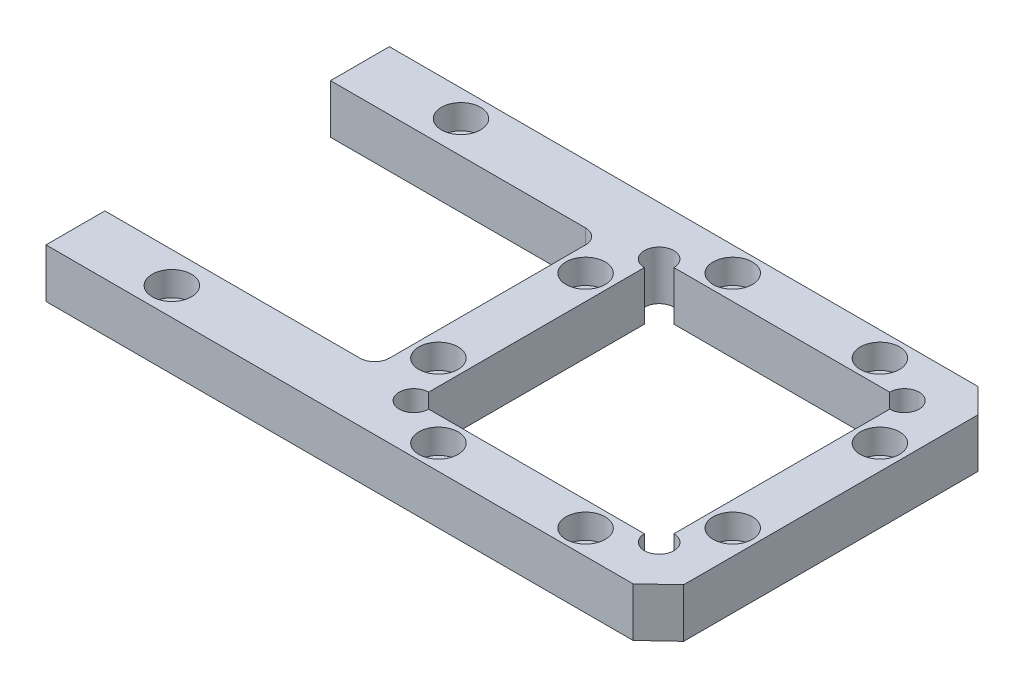
ISO-10303-21;
HEADER;
FILE_DESCRIPTION(('STEP AP214'),'2;1');
FILE_NAME('part.step','',(''),(''),'','','');
FILE_SCHEMA(('AUTOMOTIVE_DESIGN { 1 0 10303 214 1 1 1 1 }'));
ENDSEC;
DATA;
#1=APPLICATION_CONTEXT('core data for automotive mechanical design processes');
#2=APPLICATION_PROTOCOL_DEFINITION('international standard','automotive_design',2000,#1);
#3=PRODUCT_CONTEXT('',#1,'mechanical');
#4=PRODUCT('Part','Part','',(#3));
#5=PRODUCT_RELATED_PRODUCT_CATEGORY('part','',(#4));
#6=PRODUCT_DEFINITION_FORMATION('','',#4);
#7=PRODUCT_DEFINITION_CONTEXT('part definition',#1,'design');
#8=PRODUCT_DEFINITION('design','',#6,#7);
#9=PRODUCT_DEFINITION_SHAPE('','',#8);
#10=(LENGTH_UNIT() NAMED_UNIT(*) SI_UNIT(.MILLI.,.METRE.));
#11=(NAMED_UNIT(*) PLANE_ANGLE_UNIT() SI_UNIT($,.RADIAN.));
#12=(NAMED_UNIT(*) SI_UNIT($,.STERADIAN.) SOLID_ANGLE_UNIT());
#13=UNCERTAINTY_MEASURE_WITH_UNIT(LENGTH_MEASURE(1.E-05),#10,'distance_accuracy_value','');
#14=(GEOMETRIC_REPRESENTATION_CONTEXT(3) GLOBAL_UNCERTAINTY_ASSIGNED_CONTEXT((#13)) GLOBAL_UNIT_ASSIGNED_CONTEXT((#10,
#11,#12)) REPRESENTATION_CONTEXT('',''));
#15=CARTESIAN_POINT('',(0.,0.,0.));
#16=DIRECTION('',(0.,0.,1.));
#17=DIRECTION('',(1.,0.,0.));
#18=AXIS2_PLACEMENT_3D('',#15,#16,#17);
#19=CARTESIAN_POINT('',(0.,10.,0.));
#20=DIRECTION('',(1.,0.,0.));
#21=DIRECTION('',(0.,0.,-1.));
#22=AXIS2_PLACEMENT_3D('',#19,#20,#21);
#23=PLANE('',#22);
#24=DIRECTION('',(0.,0.,1.));
#25=VECTOR('',#24,1.);
#26=CARTESIAN_POINT('',(0.,0.,0.));
#27=LINE('',#26,#25);
#28=CARTESIAN_POINT('',(0.,0.,-70.));
#29=VERTEX_POINT('',#28);
#30=CARTESIAN_POINT('',(0.,0.,-58.));
#31=VERTEX_POINT('',#30);
#32=EDGE_CURVE('E303',#29,#31,#27,.T.);
#33=ORIENTED_EDGE('',*,*,#32,.T.);
#34=DIRECTION('',(0.,1.,0.));
#35=VECTOR('',#34,1.);
#36=CARTESIAN_POINT('',(0.,0.,-58.));
#37=LINE('',#36,#35);
#38=CARTESIAN_POINT('',(0.,10.,-58.));
#39=VERTEX_POINT('',#38);
#40=EDGE_CURVE('E294',#31,#39,#37,.T.);
#41=ORIENTED_EDGE('',*,*,#40,.T.);
#42=DIRECTION('',(0.,0.,1.));
#43=VECTOR('',#42,1.);
#44=CARTESIAN_POINT('',(0.,10.,0.));
#45=LINE('',#44,#43);
#46=CARTESIAN_POINT('',(0.,10.,-70.));
#47=VERTEX_POINT('',#46);
#48=EDGE_CURVE('E312',#47,#39,#45,.T.);
#49=ORIENTED_EDGE('',*,*,#48,.F.);
#50=DIRECTION('',(0.,-1.,0.));
#51=VECTOR('',#50,1.);
#52=CARTESIAN_POINT('',(0.,10.,-70.));
#53=LINE('',#52,#51);
#54=EDGE_CURVE('E331',#47,#29,#53,.T.);
#55=ORIENTED_EDGE('',*,*,#54,.T.);
#56=EDGE_LOOP('',(#33,#41,#49,#55));
#57=FACE_BOUND('',#56,.T.);
#58=ADVANCED_FACE('F66',(#57),#23,.F.);
#59=CARTESIAN_POINT('',(119.666666666667,10.,0.));
#60=DIRECTION('',(0.,0.,-1.));
#61=DIRECTION('',(-1.,0.,0.));
#62=AXIS2_PLACEMENT_3D('',#59,#60,#61);
#63=PLANE('',#62);
#64=DIRECTION('',(1.,0.,0.));
#65=VECTOR('',#64,1.);
#66=CARTESIAN_POINT('',(119.666666666667,0.,0.));
#67=LINE('',#66,#65);
#68=CARTESIAN_POINT('',(0.,0.,0.));
#69=VERTEX_POINT('',#68);
#70=CARTESIAN_POINT('',(119.666666666667,0.,0.));
#71=VERTEX_POINT('',#70);
#72=EDGE_CURVE('E297',#69,#71,#67,.T.);
#73=ORIENTED_EDGE('',*,*,#72,.T.);
#74=DIRECTION('',(0.,-1.,0.));
#75=VECTOR('',#74,1.);
#76=CARTESIAN_POINT('',(119.666666666667,10.,0.));
#77=LINE('',#76,#75);
#78=CARTESIAN_POINT('',(119.666666666667,10.,0.));
#79=VERTEX_POINT('',#78);
#80=EDGE_CURVE('E343',#79,#71,#77,.T.);
#81=ORIENTED_EDGE('',*,*,#80,.F.);
#82=DIRECTION('',(1.,0.,0.));
#83=VECTOR('',#82,1.);
#84=CARTESIAN_POINT('',(119.666666666667,10.,0.));
#85=LINE('',#84,#83);
#86=CARTESIAN_POINT('',(0.,10.,0.));
#87=VERTEX_POINT('',#86);
#88=EDGE_CURVE('E299',#87,#79,#85,.T.);
#89=ORIENTED_EDGE('',*,*,#88,.F.);
#90=DIRECTION('',(0.,-1.,0.));
#91=VECTOR('',#90,1.);
#92=CARTESIAN_POINT('',(0.,10.,0.));
#93=LINE('',#92,#91);
#94=EDGE_CURVE('E315',#87,#69,#93,.T.);
#95=ORIENTED_EDGE('',*,*,#94,.T.);
#96=EDGE_LOOP('',(#73,#81,#89,#95));
#97=FACE_BOUND('',#96,.T.);
#98=ADVANCED_FACE('F394',(#97),#63,.F.);
#99=CARTESIAN_POINT('',(125.,10.,-5.));
#100=DIRECTION('',(-0.683941128881332,0.,-0.729537204140083));
#101=DIRECTION('',(-0.729537204140083,0.,0.683941128881332));
#102=AXIS2_PLACEMENT_3D('',#99,#100,#101);
#103=PLANE('',#102);
#104=DIRECTION('',(0.729537204140083,0.,-0.683941128881332));
#105=VECTOR('',#104,1.);
#106=CARTESIAN_POINT('',(125.,0.,-5.));
#107=LINE('',#106,#105);
#108=CARTESIAN_POINT('',(125.,0.,-5.));
#109=VERTEX_POINT('',#108);
#110=EDGE_CURVE('E318',#71,#109,#107,.T.);
#111=ORIENTED_EDGE('',*,*,#110,.T.);
#112=DIRECTION('',(0.,-1.,0.));
#113=VECTOR('',#112,1.);
#114=CARTESIAN_POINT('',(125.,10.,-5.));
#115=LINE('',#114,#113);
#116=CARTESIAN_POINT('',(125.,10.,-5.));
#117=VERTEX_POINT('',#116);
#118=EDGE_CURVE('E340',#117,#109,#115,.T.);
#119=ORIENTED_EDGE('',*,*,#118,.F.);
#120=DIRECTION('',(0.729537204140083,0.,-0.683941128881332));
#121=VECTOR('',#120,1.);
#122=CARTESIAN_POINT('',(125.,10.,-5.));
#123=LINE('',#122,#121);
#124=EDGE_CURVE('E302',#79,#117,#123,.T.);
#125=ORIENTED_EDGE('',*,*,#124,.F.);
#126=ORIENTED_EDGE('',*,*,#80,.T.);
#127=EDGE_LOOP('',(#111,#119,#125,#126));
#128=FACE_BOUND('',#127,.T.);
#129=ADVANCED_FACE('F390',(#128),#103,.F.);
#130=CARTESIAN_POINT('',(125.,10.,-65.));
#131=DIRECTION('',(-1.,0.,0.));
#132=DIRECTION('',(0.,0.,1.));
#133=AXIS2_PLACEMENT_3D('',#130,#131,#132);
#134=PLANE('',#133);
#135=DIRECTION('',(0.,0.,-1.));
#136=VECTOR('',#135,1.);
#137=CARTESIAN_POINT('',(125.,0.,-65.));
#138=LINE('',#137,#136);
#139=CARTESIAN_POINT('',(125.,0.,-65.));
#140=VERTEX_POINT('',#139);
#141=EDGE_CURVE('E320',#109,#140,#138,.T.);
#142=ORIENTED_EDGE('',*,*,#141,.T.);
#143=DIRECTION('',(0.,-1.,0.));
#144=VECTOR('',#143,1.);
#145=CARTESIAN_POINT('',(125.,10.,-65.));
#146=LINE('',#145,#144);
#147=CARTESIAN_POINT('',(125.,10.,-65.));
#148=VERTEX_POINT('',#147);
#149=EDGE_CURVE('E337',#148,#140,#146,.T.);
#150=ORIENTED_EDGE('',*,*,#149,.F.);
#151=DIRECTION('',(0.,0.,-1.));
#152=VECTOR('',#151,1.);
#153=CARTESIAN_POINT('',(125.,10.,-65.));
#154=LINE('',#153,#152);
#155=EDGE_CURVE('E305',#117,#148,#154,.T.);
#156=ORIENTED_EDGE('',*,*,#155,.F.);
#157=ORIENTED_EDGE('',*,*,#118,.T.);
#158=EDGE_LOOP('',(#142,#150,#156,#157));
#159=FACE_BOUND('',#158,.T.);
#160=ADVANCED_FACE('F386',(#159),#134,.F.);
#161=CARTESIAN_POINT('',(120.,10.,-70.));
#162=DIRECTION('',(-0.707106781186548,0.,0.707106781186548));
#163=DIRECTION('',(0.707106781186548,0.,0.707106781186548));
#164=AXIS2_PLACEMENT_3D('',#161,#162,#163);
#165=PLANE('',#164);
#166=DIRECTION('',(-0.707106781186547,0.,-0.707106781186547));
#167=VECTOR('',#166,1.);
#168=CARTESIAN_POINT('',(120.,0.,-70.));
#169=LINE('',#168,#167);
#170=CARTESIAN_POINT('',(120.,0.,-70.));
#171=VERTEX_POINT('',#170);
#172=EDGE_CURVE('E322',#140,#171,#169,.T.);
#173=ORIENTED_EDGE('',*,*,#172,.T.);
#174=DIRECTION('',(0.,-1.,0.));
#175=VECTOR('',#174,1.);
#176=CARTESIAN_POINT('',(120.,10.,-70.));
#177=LINE('',#176,#175);
#178=CARTESIAN_POINT('',(120.,10.,-70.));
#179=VERTEX_POINT('',#178);
#180=EDGE_CURVE('E334',#179,#171,#177,.T.);
#181=ORIENTED_EDGE('',*,*,#180,.F.);
#182=DIRECTION('',(-0.707106781186547,0.,-0.707106781186547));
#183=VECTOR('',#182,1.);
#184=CARTESIAN_POINT('',(120.,10.,-70.));
#185=LINE('',#184,#183);
#186=EDGE_CURVE('E307',#148,#179,#185,.T.);
#187=ORIENTED_EDGE('',*,*,#186,.F.);
#188=ORIENTED_EDGE('',*,*,#149,.T.);
#189=EDGE_LOOP('',(#173,#181,#187,#188));
#190=FACE_BOUND('',#189,.T.);
#191=ADVANCED_FACE('F381',(#190),#165,.F.);
#192=CARTESIAN_POINT('',(0.,10.,-70.));
#193=DIRECTION('',(0.,0.,1.));
#194=DIRECTION('',(1.,0.,0.));
#195=AXIS2_PLACEMENT_3D('',#192,#193,#194);
#196=PLANE('',#195);
#197=DIRECTION('',(-1.,0.,0.));
#198=VECTOR('',#197,1.);
#199=CARTESIAN_POINT('',(0.,0.,-70.));
#200=LINE('',#199,#198);
#201=EDGE_CURVE('E324',#171,#29,#200,.T.);
#202=ORIENTED_EDGE('',*,*,#201,.T.);
#203=ORIENTED_EDGE('',*,*,#54,.F.);
#204=DIRECTION('',(-1.,0.,0.));
#205=VECTOR('',#204,1.);
#206=CARTESIAN_POINT('',(0.,10.,-70.));
#207=LINE('',#206,#205);
#208=EDGE_CURVE('E309',#179,#47,#207,.T.);
#209=ORIENTED_EDGE('',*,*,#208,.F.);
#210=ORIENTED_EDGE('',*,*,#180,.T.);
#211=EDGE_LOOP('',(#202,#203,#209,#210));
#212=FACE_BOUND('',#211,.T.);
#213=ADVANCED_FACE('F377',(#212),#196,.F.);
#214=CARTESIAN_POINT('',(0.,10.,-12.));
#215=VERTEX_POINT('',#214);
#216=EDGE_CURVE('E311',#215,#87,#45,.T.);
#217=ORIENTED_EDGE('',*,*,#216,.F.);
#218=DIRECTION('',(0.,1.,0.));
#219=VECTOR('',#218,1.);
#220=CARTESIAN_POINT('',(0.,0.,-12.));
#221=LINE('',#220,#219);
#222=CARTESIAN_POINT('',(0.,0.,-12.));
#223=VERTEX_POINT('',#222);
#224=EDGE_CURVE('E287',#223,#215,#221,.T.);
#225=ORIENTED_EDGE('',*,*,#224,.F.);
#226=EDGE_CURVE('E326',#223,#69,#27,.T.);
#227=ORIENTED_EDGE('',*,*,#226,.T.);
#228=ORIENTED_EDGE('',*,*,#94,.F.);
#229=EDGE_LOOP('',(#217,#225,#227,#228));
#230=FACE_BOUND('',#229,.T.);
#231=ADVANCED_FACE('F401',(#230),#23,.F.);
#232=CARTESIAN_POINT('',(0.,10.,0.));
#233=DIRECTION('',(0.,-1.,0.));
#234=DIRECTION('',(0.,0.,-1.));
#235=AXIS2_PLACEMENT_3D('',#232,#233,#234);
#236=PLANE('',#235);
#237=CARTESIAN_POINT('',(120.,10.,-20.));
#238=DIRECTION('',(0.,1.,0.));
#239=DIRECTION('',(0.,0.,1.));
#240=AXIS2_PLACEMENT_3D('',#237,#238,#239);
#241=CIRCLE('',#240,4.00000000000001);
#242=CARTESIAN_POINT('',(120.,10.,-16.));
#243=VERTEX_POINT('',#242);
#244=EDGE_CURVE('E888',#243,#243,#241,.T.);
#245=ORIENTED_EDGE('',*,*,#244,.F.);
#246=EDGE_LOOP('',(#245));
#247=FACE_BOUND('',#246,.T.);
#248=CARTESIAN_POINT('',(105.,10.,-65.));
#249=DIRECTION('',(0.,1.,0.));
#250=DIRECTION('',(0.,0.,1.));
#251=AXIS2_PLACEMENT_3D('',#248,#249,#250);
#252=CIRCLE('',#251,4.00000000000001);
#253=CARTESIAN_POINT('',(105.,10.,-61.));
#254=VERTEX_POINT('',#253);
#255=EDGE_CURVE('E889',#254,#254,#252,.T.);
#256=ORIENTED_EDGE('',*,*,#255,.F.);
#257=EDGE_LOOP('',(#256));
#258=FACE_BOUND('',#257,.T.);
#259=CARTESIAN_POINT('',(75.,10.,-65.));
#260=DIRECTION('',(0.,1.,0.));
#261=DIRECTION('',(0.,0.,1.));
#262=AXIS2_PLACEMENT_3D('',#259,#260,#261);
#263=CIRCLE('',#262,4.00000000000001);
#264=CARTESIAN_POINT('',(75.,10.,-61.));
#265=VERTEX_POINT('',#264);
#266=EDGE_CURVE('E901',#265,#265,#263,.T.);
#267=ORIENTED_EDGE('',*,*,#266,.F.);
#268=EDGE_LOOP('',(#267));
#269=FACE_BOUND('',#268,.T.);
#270=CARTESIAN_POINT('',(75.,10.,-5.));
#271=DIRECTION('',(0.,1.,0.));
#272=DIRECTION('',(0.,0.,1.));
#273=AXIS2_PLACEMENT_3D('',#270,#271,#272);
#274=CIRCLE('',#273,4.00000000000001);
#275=CARTESIAN_POINT('',(75.,10.,-0.999999999999995));
#276=VERTEX_POINT('',#275);
#277=EDGE_CURVE('E907',#276,#276,#274,.T.);
#278=ORIENTED_EDGE('',*,*,#277,.F.);
#279=EDGE_LOOP('',(#278));
#280=FACE_BOUND('',#279,.T.);
#281=CARTESIAN_POINT('',(60.,10.,-20.));
#282=DIRECTION('',(0.,1.,0.));
#283=DIRECTION('',(0.,0.,1.));
#284=AXIS2_PLACEMENT_3D('',#281,#282,#283);
#285=CIRCLE('',#284,4.00000000000001);
#286=CARTESIAN_POINT('',(60.,10.,-16.));
#287=VERTEX_POINT('',#286);
#288=EDGE_CURVE('E988',#287,#287,#285,.T.);
#289=ORIENTED_EDGE('',*,*,#288,.F.);
#290=EDGE_LOOP('',(#289));
#291=FACE_BOUND('',#290,.T.);
#292=CARTESIAN_POINT('',(60.,10.,-50.));
#293=DIRECTION('',(0.,1.,0.));
#294=DIRECTION('',(0.,0.,1.));
#295=AXIS2_PLACEMENT_3D('',#292,#293,#294);
#296=CIRCLE('',#295,4.00000000000001);
#297=CARTESIAN_POINT('',(60.,10.,-46.));
#298=VERTEX_POINT('',#297);
#299=EDGE_CURVE('E979',#298,#298,#296,.T.);
#300=ORIENTED_EDGE('',*,*,#299,.F.);
#301=EDGE_LOOP('',(#300));
#302=FACE_BOUND('',#301,.T.);
#303=CARTESIAN_POINT('',(105.,10.,-5.));
#304=DIRECTION('',(0.,1.,0.));
#305=DIRECTION('',(0.,0.,1.));
#306=AXIS2_PLACEMENT_3D('',#303,#304,#305);
#307=CIRCLE('',#306,4.00000000000001);
#308=CARTESIAN_POINT('',(105.,10.,-0.999999999999994));
#309=VERTEX_POINT('',#308);
#310=EDGE_CURVE('E913',#309,#309,#307,.T.);
#311=ORIENTED_EDGE('',*,*,#310,.F.);
#312=EDGE_LOOP('',(#311));
#313=FACE_BOUND('',#312,.T.);
#314=CARTESIAN_POINT('',(120.,10.,-50.));
#315=DIRECTION('',(0.,1.,0.));
#316=DIRECTION('',(0.,0.,1.));
#317=AXIS2_PLACEMENT_3D('',#314,#315,#316);
#318=CIRCLE('',#317,4.00000000000001);
#319=CARTESIAN_POINT('',(120.,10.,-46.));
#320=VERTEX_POINT('',#319);
#321=EDGE_CURVE('E892',#320,#320,#318,.T.);
#322=ORIENTED_EDGE('',*,*,#321,.F.);
#323=EDGE_LOOP('',(#322));
#324=FACE_BOUND('',#323,.T.);
#325=CARTESIAN_POINT('',(20.,10.,-64.5977565397984));
#326=DIRECTION('',(0.,1.,0.));
#327=DIRECTION('',(0.,0.,1.));
#328=AXIS2_PLACEMENT_3D('',#325,#326,#327);
#329=CIRCLE('',#328,4.);
#330=CARTESIAN_POINT('',(20.,10.,-60.5977565397984));
#331=VERTEX_POINT('',#330);
#332=EDGE_CURVE('E933',#331,#331,#329,.T.);
#333=ORIENTED_EDGE('',*,*,#332,.F.);
#334=EDGE_LOOP('',(#333));
#335=FACE_BOUND('',#334,.T.);
#336=CARTESIAN_POINT('',(20.,10.,-5.65850109258082));
#337=DIRECTION('',(0.,1.,0.));
#338=DIRECTION('',(0.,0.,1.));
#339=AXIS2_PLACEMENT_3D('',#336,#337,#338);
#340=CIRCLE('',#339,4.);
#341=CARTESIAN_POINT('',(20.,10.,-1.65850109258082));
#342=VERTEX_POINT('',#341);
#343=EDGE_CURVE('E935',#342,#342,#340,.T.);
#344=ORIENTED_EDGE('',*,*,#343,.F.);
#345=EDGE_LOOP('',(#344));
#346=FACE_BOUND('',#345,.T.);
#347=DIRECTION('',(0.,0.,1.));
#348=VECTOR('',#347,1.);
#349=CARTESIAN_POINT('',(65.,10.,0.));
#350=LINE('',#349,#348);
#351=CARTESIAN_POINT('',(65.,10.,-57.));
#352=VERTEX_POINT('',#351);
#353=CARTESIAN_POINT('',(65.,10.,-13.));
#354=VERTEX_POINT('',#353);
#355=EDGE_CURVE('E248',#352,#354,#350,.T.);
#356=ORIENTED_EDGE('',*,*,#355,.F.);
#357=CARTESIAN_POINT('',(65.,10.,-60.));
#358=DIRECTION('',(0.,1.,0.));
#359=DIRECTION('',(0.,0.,1.));
#360=AXIS2_PLACEMENT_3D('',#357,#358,#359);
#361=CIRCLE('',#360,3.00000000000001);
#362=CARTESIAN_POINT('',(68.,10.,-60.));
#363=VERTEX_POINT('',#362);
#364=EDGE_CURVE('E209',#363,#352,#361,.T.);
#365=ORIENTED_EDGE('',*,*,#364,.F.);
#366=DIRECTION('',(1.,0.,0.));
#367=VECTOR('',#366,1.);
#368=CARTESIAN_POINT('',(0.,10.,-60.));
#369=LINE('',#368,#367);
#370=CARTESIAN_POINT('',(112.,10.,-60.));
#371=VERTEX_POINT('',#370);
#372=EDGE_CURVE('E226',#363,#371,#369,.T.);
#373=ORIENTED_EDGE('',*,*,#372,.T.);
#374=CARTESIAN_POINT('',(115.,10.,-60.));
#375=DIRECTION('',(0.,1.,0.));
#376=DIRECTION('',(0.,0.,1.));
#377=AXIS2_PLACEMENT_3D('',#374,#375,#376);
#378=CIRCLE('',#377,3.00000000000001);
#379=CARTESIAN_POINT('',(115.,10.,-57.));
#380=VERTEX_POINT('',#379);
#381=EDGE_CURVE('E229',#380,#371,#378,.T.);
#382=ORIENTED_EDGE('',*,*,#381,.F.);
#383=DIRECTION('',(0.,0.,1.));
#384=VECTOR('',#383,1.);
#385=CARTESIAN_POINT('',(115.,10.,0.));
#386=LINE('',#385,#384);
#387=CARTESIAN_POINT('',(115.,10.,-13.));
#388=VERTEX_POINT('',#387);
#389=EDGE_CURVE('E260',#380,#388,#386,.T.);
#390=ORIENTED_EDGE('',*,*,#389,.T.);
#391=CARTESIAN_POINT('',(115.,10.,-10.));
#392=DIRECTION('',(0.,1.,0.));
#393=DIRECTION('',(0.,0.,1.));
#394=AXIS2_PLACEMENT_3D('',#391,#392,#393);
#395=CIRCLE('',#394,3.00000000000001);
#396=CARTESIAN_POINT('',(112.,10.,-10.));
#397=VERTEX_POINT('',#396);
#398=EDGE_CURVE('E257',#397,#388,#395,.T.);
#399=ORIENTED_EDGE('',*,*,#398,.F.);
#400=DIRECTION('',(1.,0.,0.));
#401=VECTOR('',#400,1.);
#402=CARTESIAN_POINT('',(0.,10.,-10.));
#403=LINE('',#402,#401);
#404=CARTESIAN_POINT('',(68.,10.,-10.));
#405=VERTEX_POINT('',#404);
#406=EDGE_CURVE('E254',#405,#397,#403,.T.);
#407=ORIENTED_EDGE('',*,*,#406,.F.);
#408=CARTESIAN_POINT('',(65.,10.,-10.));
#409=DIRECTION('',(0.,1.,0.));
#410=DIRECTION('',(0.,0.,1.));
#411=AXIS2_PLACEMENT_3D('',#408,#409,#410);
#412=CIRCLE('',#411,3.00000000000001);
#413=EDGE_CURVE('E251',#354,#405,#412,.T.);
#414=ORIENTED_EDGE('',*,*,#413,.F.);
#415=EDGE_LOOP('',(#356,#365,#373,#382,#390,#399,#407,#414));
#416=FACE_BOUND('',#415,.T.);
#417=ORIENTED_EDGE('',*,*,#48,.T.);
#418=DIRECTION('',(-1.,0.,0.));
#419=VECTOR('',#418,1.);
#420=CARTESIAN_POINT('',(0.,10.,-58.));
#421=LINE('',#420,#419);
#422=CARTESIAN_POINT('',(52.,10.,-58.));
#423=VERTEX_POINT('',#422);
#424=EDGE_CURVE('E283',#423,#39,#421,.T.);
#425=ORIENTED_EDGE('',*,*,#424,.F.);
#426=CARTESIAN_POINT('',(52.,10.,-55.));
#427=DIRECTION('',(0.,-1.,0.));
#428=DIRECTION('',(0.,0.,-1.));
#429=AXIS2_PLACEMENT_3D('',#426,#427,#428);
#430=CIRCLE('',#429,3.);
#431=CARTESIAN_POINT('',(55.,10.,-55.));
#432=VERTEX_POINT('',#431);
#433=EDGE_CURVE('E74',#423,#432,#430,.T.);
#434=ORIENTED_EDGE('',*,*,#433,.T.);
#435=DIRECTION('',(0.,0.,-1.));
#436=VECTOR('',#435,1.);
#437=CARTESIAN_POINT('',(55.,10.,-58.));
#438=LINE('',#437,#436);
#439=CARTESIAN_POINT('',(55.,10.,-15.));
#440=VERTEX_POINT('',#439);
#441=EDGE_CURVE('E290',#440,#432,#438,.T.);
#442=ORIENTED_EDGE('',*,*,#441,.F.);
#443=CARTESIAN_POINT('',(52.,10.,-15.));
#444=DIRECTION('',(0.,-1.,0.));
#445=DIRECTION('',(0.,0.,-1.));
#446=AXIS2_PLACEMENT_3D('',#443,#444,#445);
#447=CIRCLE('',#446,3.);
#448=CARTESIAN_POINT('',(52.,10.,-12.));
#449=VERTEX_POINT('',#448);
#450=EDGE_CURVE('E355',#440,#449,#447,.T.);
#451=ORIENTED_EDGE('',*,*,#450,.T.);
#452=DIRECTION('',(1.,0.,0.));
#453=VECTOR('',#452,1.);
#454=CARTESIAN_POINT('',(0.,10.,-12.));
#455=LINE('',#454,#453);
#456=EDGE_CURVE('E267',#215,#449,#455,.T.);
#457=ORIENTED_EDGE('',*,*,#456,.F.);
#458=ORIENTED_EDGE('',*,*,#216,.T.);
#459=ORIENTED_EDGE('',*,*,#88,.T.);
#460=ORIENTED_EDGE('',*,*,#124,.T.);
#461=ORIENTED_EDGE('',*,*,#155,.T.);
#462=ORIENTED_EDGE('',*,*,#186,.T.);
#463=ORIENTED_EDGE('',*,*,#208,.T.);
#464=EDGE_LOOP('',(#417,#425,#434,#442,#451,#457,#458,#459,#460,#461,#462,#463));
#465=FACE_BOUND('',#464,.T.);
#466=ADVANCED_FACE('F361',(#247,#258,#269,#280,#291,#302,#313,#324,#335,#346,#416,#465),#236,.F.);
#467=CARTESIAN_POINT('',(0.,0.,0.));
#468=DIRECTION('',(0.,-1.,0.));
#469=DIRECTION('',(0.,0.,-1.));
#470=AXIS2_PLACEMENT_3D('',#467,#468,#469);
#471=PLANE('',#470);
#472=CARTESIAN_POINT('',(20.,0.,-64.5977565397984));
#473=DIRECTION('',(0.,1.,0.));
#474=DIRECTION('',(0.,0.,1.));
#475=AXIS2_PLACEMENT_3D('',#472,#473,#474);
#476=CIRCLE('',#475,2.5);
#477=CARTESIAN_POINT('',(20.,0.,-62.0977565397984));
#478=VERTEX_POINT('',#477);
#479=EDGE_CURVE('E920',#478,#478,#476,.T.);
#480=ORIENTED_EDGE('',*,*,#479,.T.);
#481=EDGE_LOOP('',(#480));
#482=FACE_BOUND('',#481,.T.);
#483=CARTESIAN_POINT('',(20.,0.,-5.65850109258082));
#484=DIRECTION('',(0.,1.,0.));
#485=DIRECTION('',(0.,0.,1.));
#486=AXIS2_PLACEMENT_3D('',#483,#484,#485);
#487=CIRCLE('',#486,2.5);
#488=CARTESIAN_POINT('',(20.,0.,-3.15850109258082));
#489=VERTEX_POINT('',#488);
#490=EDGE_CURVE('E917',#489,#489,#487,.T.);
#491=ORIENTED_EDGE('',*,*,#490,.T.);
#492=EDGE_LOOP('',(#491));
#493=FACE_BOUND('',#492,.T.);
#494=CARTESIAN_POINT('',(65.,0.,-60.));
#495=DIRECTION('',(0.,1.,0.));
#496=DIRECTION('',(0.,0.,1.));
#497=AXIS2_PLACEMENT_3D('',#494,#495,#496);
#498=CIRCLE('',#497,3.00000000000001);
#499=CARTESIAN_POINT('',(68.,0.,-60.));
#500=VERTEX_POINT('',#499);
#501=CARTESIAN_POINT('',(65.,0.,-57.));
#502=VERTEX_POINT('',#501);
#503=EDGE_CURVE('E206',#500,#502,#498,.T.);
#504=ORIENTED_EDGE('',*,*,#503,.T.);
#505=DIRECTION('',(0.,0.,1.));
#506=VECTOR('',#505,1.);
#507=CARTESIAN_POINT('',(65.,0.,0.));
#508=LINE('',#507,#506);
#509=CARTESIAN_POINT('',(65.,0.,-13.));
#510=VERTEX_POINT('',#509);
#511=EDGE_CURVE('E218',#502,#510,#508,.T.);
#512=ORIENTED_EDGE('',*,*,#511,.T.);
#513=CARTESIAN_POINT('',(65.,0.,-10.));
#514=DIRECTION('',(0.,1.,0.));
#515=DIRECTION('',(0.,0.,1.));
#516=AXIS2_PLACEMENT_3D('',#513,#514,#515);
#517=CIRCLE('',#516,3.00000000000001);
#518=CARTESIAN_POINT('',(68.,0.,-10.));
#519=VERTEX_POINT('',#518);
#520=EDGE_CURVE('E222',#510,#519,#517,.T.);
#521=ORIENTED_EDGE('',*,*,#520,.T.);
#522=DIRECTION('',(1.,0.,0.));
#523=VECTOR('',#522,1.);
#524=CARTESIAN_POINT('',(0.,0.,-10.));
#525=LINE('',#524,#523);
#526=CARTESIAN_POINT('',(112.,0.,-10.));
#527=VERTEX_POINT('',#526);
#528=EDGE_CURVE('E236',#519,#527,#525,.T.);
#529=ORIENTED_EDGE('',*,*,#528,.T.);
#530=CARTESIAN_POINT('',(115.,0.,-10.));
#531=DIRECTION('',(0.,1.,0.));
#532=DIRECTION('',(0.,0.,1.));
#533=AXIS2_PLACEMENT_3D('',#530,#531,#532);
#534=CIRCLE('',#533,3.00000000000001);
#535=CARTESIAN_POINT('',(115.,0.,-13.));
#536=VERTEX_POINT('',#535);
#537=EDGE_CURVE('E239',#527,#536,#534,.T.);
#538=ORIENTED_EDGE('',*,*,#537,.T.);
#539=DIRECTION('',(0.,0.,1.));
#540=VECTOR('',#539,1.);
#541=CARTESIAN_POINT('',(115.,0.,0.));
#542=LINE('',#541,#540);
#543=CARTESIAN_POINT('',(115.,0.,-57.));
#544=VERTEX_POINT('',#543);
#545=EDGE_CURVE('E242',#544,#536,#542,.T.);
#546=ORIENTED_EDGE('',*,*,#545,.F.);
#547=CARTESIAN_POINT('',(115.,0.,-60.));
#548=DIRECTION('',(0.,1.,0.));
#549=DIRECTION('',(0.,0.,1.));
#550=AXIS2_PLACEMENT_3D('',#547,#548,#549);
#551=CIRCLE('',#550,3.00000000000001);
#552=CARTESIAN_POINT('',(112.,0.,-60.));
#553=VERTEX_POINT('',#552);
#554=EDGE_CURVE('E244',#544,#553,#551,.T.);
#555=ORIENTED_EDGE('',*,*,#554,.T.);
#556=DIRECTION('',(1.,0.,0.));
#557=VECTOR('',#556,1.);
#558=CARTESIAN_POINT('',(0.,0.,-60.));
#559=LINE('',#558,#557);
#560=EDGE_CURVE('E214',#500,#553,#559,.T.);
#561=ORIENTED_EDGE('',*,*,#560,.F.);
#562=EDGE_LOOP('',(#504,#512,#521,#529,#538,#546,#555,#561));
#563=FACE_BOUND('',#562,.T.);
#564=DIRECTION('',(0.,0.,-1.));
#565=VECTOR('',#564,1.);
#566=CARTESIAN_POINT('',(55.,0.,-58.));
#567=LINE('',#566,#565);
#568=CARTESIAN_POINT('',(55.,0.,-15.));
#569=VERTEX_POINT('',#568);
#570=CARTESIAN_POINT('',(55.,0.,-55.));
#571=VERTEX_POINT('',#570);
#572=EDGE_CURVE('E282',#569,#571,#567,.T.);
#573=ORIENTED_EDGE('',*,*,#572,.T.);
#574=CARTESIAN_POINT('',(52.,0.,-55.));
#575=DIRECTION('',(0.,-1.,0.));
#576=DIRECTION('',(0.,0.,-1.));
#577=AXIS2_PLACEMENT_3D('',#574,#575,#576);
#578=CIRCLE('',#577,3.);
#579=CARTESIAN_POINT('',(52.,0.,-58.));
#580=VERTEX_POINT('',#579);
#581=EDGE_CURVE('E12',#571,#580,#578,.F.);
#582=ORIENTED_EDGE('',*,*,#581,.T.);
#583=DIRECTION('',(-1.,0.,0.));
#584=VECTOR('',#583,1.);
#585=CARTESIAN_POINT('',(0.,0.,-58.));
#586=LINE('',#585,#584);
#587=EDGE_CURVE('E285',#580,#31,#586,.T.);
#588=ORIENTED_EDGE('',*,*,#587,.T.);
#589=ORIENTED_EDGE('',*,*,#32,.F.);
#590=ORIENTED_EDGE('',*,*,#201,.F.);
#591=ORIENTED_EDGE('',*,*,#172,.F.);
#592=ORIENTED_EDGE('',*,*,#141,.F.);
#593=ORIENTED_EDGE('',*,*,#110,.F.);
#594=ORIENTED_EDGE('',*,*,#72,.F.);
#595=ORIENTED_EDGE('',*,*,#226,.F.);
#596=DIRECTION('',(1.,0.,0.));
#597=VECTOR('',#596,1.);
#598=CARTESIAN_POINT('',(0.,0.,-12.));
#599=LINE('',#598,#597);
#600=CARTESIAN_POINT('',(52.,0.,-12.));
#601=VERTEX_POINT('',#600);
#602=EDGE_CURVE('E279',#223,#601,#599,.T.);
#603=ORIENTED_EDGE('',*,*,#602,.T.);
#604=CARTESIAN_POINT('',(52.,0.,-15.));
#605=DIRECTION('',(0.,-1.,0.));
#606=DIRECTION('',(0.,0.,-1.));
#607=AXIS2_PLACEMENT_3D('',#604,#605,#606);
#608=CIRCLE('',#607,3.);
#609=EDGE_CURVE('E357',#601,#569,#608,.F.);
#610=ORIENTED_EDGE('',*,*,#609,.T.);
#611=EDGE_LOOP('',(#573,#582,#588,#589,#590,#591,#592,#593,#594,#595,#603,#610));
#612=FACE_BOUND('',#611,.T.);
#613=ADVANCED_FACE('F224',(#482,#493,#563,#612),#471,.T.);
#614=CARTESIAN_POINT('',(0.,0.,-58.));
#615=DIRECTION('',(0.,0.,-1.));
#616=DIRECTION('',(-1.,0.,0.));
#617=AXIS2_PLACEMENT_3D('',#614,#615,#616);
#618=PLANE('',#617);
#619=ORIENTED_EDGE('',*,*,#587,.F.);
#620=DIRECTION('',(0.,1.,0.));
#621=VECTOR('',#620,1.);
#622=CARTESIAN_POINT('',(52.,10.,-58.));
#623=LINE('',#622,#621);
#624=EDGE_CURVE('E353',#580,#423,#623,.T.);
#625=ORIENTED_EDGE('',*,*,#624,.T.);
#626=ORIENTED_EDGE('',*,*,#424,.T.);
#627=ORIENTED_EDGE('',*,*,#40,.F.);
#628=EDGE_LOOP('',(#619,#625,#626,#627));
#629=FACE_BOUND('',#628,.T.);
#630=ADVANCED_FACE('F367',(#629),#618,.F.);
#631=CARTESIAN_POINT('',(55.,0.,-58.));
#632=DIRECTION('',(1.,0.,0.));
#633=DIRECTION('',(0.,0.,-1.));
#634=AXIS2_PLACEMENT_3D('',#631,#632,#633);
#635=PLANE('',#634);
#636=ORIENTED_EDGE('',*,*,#572,.F.);
#637=DIRECTION('',(0.,1.,0.));
#638=VECTOR('',#637,1.);
#639=CARTESIAN_POINT('',(55.,10.,-15.));
#640=LINE('',#639,#638);
#641=EDGE_CURVE('E348',#569,#440,#640,.T.);
#642=ORIENTED_EDGE('',*,*,#641,.T.);
#643=ORIENTED_EDGE('',*,*,#441,.T.);
#644=DIRECTION('',(0.,1.,0.));
#645=VECTOR('',#644,1.);
#646=CARTESIAN_POINT('',(55.,0.,-55.));
#647=LINE('',#646,#645);
#648=EDGE_CURVE('E346',#432,#571,#647,.F.);
#649=ORIENTED_EDGE('',*,*,#648,.T.);
#650=EDGE_LOOP('',(#636,#642,#643,#649));
#651=FACE_BOUND('',#650,.T.);
#652=ADVANCED_FACE('F364',(#651),#635,.F.);
#653=CARTESIAN_POINT('',(0.,0.,-12.));
#654=DIRECTION('',(0.,0.,1.));
#655=DIRECTION('',(1.,0.,0.));
#656=AXIS2_PLACEMENT_3D('',#653,#654,#655);
#657=PLANE('',#656);
#658=ORIENTED_EDGE('',*,*,#456,.T.);
#659=DIRECTION('',(0.,1.,0.));
#660=VECTOR('',#659,1.);
#661=CARTESIAN_POINT('',(52.,0.,-12.));
#662=LINE('',#661,#660);
#663=EDGE_CURVE('E351',#449,#601,#662,.F.);
#664=ORIENTED_EDGE('',*,*,#663,.T.);
#665=ORIENTED_EDGE('',*,*,#602,.F.);
#666=ORIENTED_EDGE('',*,*,#224,.T.);
#667=EDGE_LOOP('',(#658,#664,#665,#666));
#668=FACE_BOUND('',#667,.T.);
#669=ADVANCED_FACE('F404',(#668),#657,.F.);
#670=CARTESIAN_POINT('',(65.,0.,-60.));
#671=DIRECTION('',(0.,1.,0.));
#672=DIRECTION('',(0.,0.,1.));
#673=AXIS2_PLACEMENT_3D('',#670,#671,#672);
#674=CYLINDRICAL_SURFACE('',#673,3.00000000000001);
#675=ORIENTED_EDGE('',*,*,#364,.T.);
#676=DIRECTION('',(0.,1.,0.));
#677=VECTOR('',#676,1.);
#678=CARTESIAN_POINT('',(65.,0.,-57.));
#679=LINE('',#678,#677);
#680=EDGE_CURVE('E202',#502,#352,#679,.T.);
#681=ORIENTED_EDGE('',*,*,#680,.F.);
#682=ORIENTED_EDGE('',*,*,#503,.F.);
#683=DIRECTION('',(0.,1.,0.));
#684=VECTOR('',#683,1.);
#685=CARTESIAN_POINT('',(68.,0.,-60.));
#686=LINE('',#685,#684);
#687=EDGE_CURVE('E265',#500,#363,#686,.T.);
#688=ORIENTED_EDGE('',*,*,#687,.T.);
#689=EDGE_LOOP('',(#675,#681,#682,#688));
#690=FACE_BOUND('',#689,.T.);
#691=ADVANCED_FACE('F204',(#690),#674,.F.);
#692=CARTESIAN_POINT('',(0.,0.,-60.));
#693=DIRECTION('',(0.,0.,1.));
#694=DIRECTION('',(1.,0.,0.));
#695=AXIS2_PLACEMENT_3D('',#692,#693,#694);
#696=PLANE('',#695);
#697=ORIENTED_EDGE('',*,*,#372,.F.);
#698=ORIENTED_EDGE('',*,*,#687,.F.);
#699=ORIENTED_EDGE('',*,*,#560,.T.);
#700=DIRECTION('',(0.,1.,0.));
#701=VECTOR('',#700,1.);
#702=CARTESIAN_POINT('',(112.,0.,-60.));
#703=LINE('',#702,#701);
#704=EDGE_CURVE('E268',#553,#371,#703,.T.);
#705=ORIENTED_EDGE('',*,*,#704,.T.);
#706=EDGE_LOOP('',(#697,#698,#699,#705));
#707=FACE_BOUND('',#706,.T.);
#708=ADVANCED_FACE('F480',(#707),#696,.T.);
#709=CARTESIAN_POINT('',(115.,0.,-60.));
#710=DIRECTION('',(0.,1.,0.));
#711=DIRECTION('',(0.,0.,1.));
#712=AXIS2_PLACEMENT_3D('',#709,#710,#711);
#713=CYLINDRICAL_SURFACE('',#712,3.00000000000001);
#714=ORIENTED_EDGE('',*,*,#381,.T.);
#715=ORIENTED_EDGE('',*,*,#704,.F.);
#716=ORIENTED_EDGE('',*,*,#554,.F.);
#717=DIRECTION('',(0.,1.,0.));
#718=VECTOR('',#717,1.);
#719=CARTESIAN_POINT('',(115.,0.,-57.));
#720=LINE('',#719,#718);
#721=EDGE_CURVE('E270',#544,#380,#720,.T.);
#722=ORIENTED_EDGE('',*,*,#721,.T.);
#723=EDGE_LOOP('',(#714,#715,#716,#722));
#724=FACE_BOUND('',#723,.T.);
#725=ADVANCED_FACE('F491',(#724),#713,.F.);
#726=CARTESIAN_POINT('',(115.,0.,0.));
#727=DIRECTION('',(-1.,0.,0.));
#728=DIRECTION('',(0.,0.,1.));
#729=AXIS2_PLACEMENT_3D('',#726,#727,#728);
#730=PLANE('',#729);
#731=ORIENTED_EDGE('',*,*,#389,.F.);
#732=ORIENTED_EDGE('',*,*,#721,.F.);
#733=ORIENTED_EDGE('',*,*,#545,.T.);
#734=DIRECTION('',(0.,1.,0.));
#735=VECTOR('',#734,1.);
#736=CARTESIAN_POINT('',(115.,0.,-13.));
#737=LINE('',#736,#735);
#738=EDGE_CURVE('E272',#536,#388,#737,.T.);
#739=ORIENTED_EDGE('',*,*,#738,.T.);
#740=EDGE_LOOP('',(#731,#732,#733,#739));
#741=FACE_BOUND('',#740,.T.);
#742=ADVANCED_FACE('F502',(#741),#730,.T.);
#743=CARTESIAN_POINT('',(115.,0.,-10.));
#744=DIRECTION('',(0.,1.,0.));
#745=DIRECTION('',(0.,0.,1.));
#746=AXIS2_PLACEMENT_3D('',#743,#744,#745);
#747=CYLINDRICAL_SURFACE('',#746,3.00000000000001);
#748=ORIENTED_EDGE('',*,*,#398,.T.);
#749=ORIENTED_EDGE('',*,*,#738,.F.);
#750=ORIENTED_EDGE('',*,*,#537,.F.);
#751=DIRECTION('',(0.,1.,0.));
#752=VECTOR('',#751,1.);
#753=CARTESIAN_POINT('',(112.,0.,-10.));
#754=LINE('',#753,#752);
#755=EDGE_CURVE('E274',#527,#397,#754,.T.);
#756=ORIENTED_EDGE('',*,*,#755,.T.);
#757=EDGE_LOOP('',(#748,#749,#750,#756));
#758=FACE_BOUND('',#757,.T.);
#759=ADVANCED_FACE('F513',(#758),#747,.F.);
#760=CARTESIAN_POINT('',(0.,0.,-10.));
#761=DIRECTION('',(0.,0.,1.));
#762=DIRECTION('',(1.,0.,0.));
#763=AXIS2_PLACEMENT_3D('',#760,#761,#762);
#764=PLANE('',#763);
#765=ORIENTED_EDGE('',*,*,#406,.T.);
#766=ORIENTED_EDGE('',*,*,#755,.F.);
#767=ORIENTED_EDGE('',*,*,#528,.F.);
#768=DIRECTION('',(0.,1.,0.));
#769=VECTOR('',#768,1.);
#770=CARTESIAN_POINT('',(68.,0.,-10.));
#771=LINE('',#770,#769);
#772=EDGE_CURVE('E276',#519,#405,#771,.T.);
#773=ORIENTED_EDGE('',*,*,#772,.T.);
#774=EDGE_LOOP('',(#765,#766,#767,#773));
#775=FACE_BOUND('',#774,.T.);
#776=ADVANCED_FACE('F524',(#775),#764,.F.);
#777=CARTESIAN_POINT('',(65.,0.,-10.));
#778=DIRECTION('',(0.,1.,0.));
#779=DIRECTION('',(0.,0.,1.));
#780=AXIS2_PLACEMENT_3D('',#777,#778,#779);
#781=CYLINDRICAL_SURFACE('',#780,3.00000000000001);
#782=ORIENTED_EDGE('',*,*,#413,.T.);
#783=ORIENTED_EDGE('',*,*,#772,.F.);
#784=ORIENTED_EDGE('',*,*,#520,.F.);
#785=DIRECTION('',(0.,1.,0.));
#786=VECTOR('',#785,1.);
#787=CARTESIAN_POINT('',(65.,0.,-13.));
#788=LINE('',#787,#786);
#789=EDGE_CURVE('E213',#510,#354,#788,.T.);
#790=ORIENTED_EDGE('',*,*,#789,.T.);
#791=EDGE_LOOP('',(#782,#783,#784,#790));
#792=FACE_BOUND('',#791,.T.);
#793=ADVANCED_FACE('F535',(#792),#781,.F.);
#794=CARTESIAN_POINT('',(65.,0.,0.));
#795=DIRECTION('',(-1.,0.,0.));
#796=DIRECTION('',(0.,0.,1.));
#797=AXIS2_PLACEMENT_3D('',#794,#795,#796);
#798=PLANE('',#797);
#799=ORIENTED_EDGE('',*,*,#355,.T.);
#800=ORIENTED_EDGE('',*,*,#789,.F.);
#801=ORIENTED_EDGE('',*,*,#511,.F.);
#802=ORIENTED_EDGE('',*,*,#680,.T.);
#803=EDGE_LOOP('',(#799,#800,#801,#802));
#804=FACE_BOUND('',#803,.T.);
#805=ADVANCED_FACE('F219',(#804),#798,.F.);
#806=CARTESIAN_POINT('',(20.,5.,-5.65850109258082));
#807=DIRECTION('',(0.,1.,0.));
#808=DIRECTION('',(0.,0.,1.));
#809=AXIS2_PLACEMENT_3D('',#806,#807,#808);
#810=CYLINDRICAL_SURFACE('',#809,4.);
#811=CARTESIAN_POINT('',(20.,5.,-5.65850109258082));
#812=DIRECTION('',(0.,1.,0.));
#813=DIRECTION('',(0.,0.,1.));
#814=AXIS2_PLACEMENT_3D('',#811,#812,#813);
#815=CIRCLE('',#814,4.);
#816=CARTESIAN_POINT('',(20.,5.,-1.65850109258082));
#817=VERTEX_POINT('',#816);
#818=EDGE_CURVE('E232',#817,#817,#815,.T.);
#819=ORIENTED_EDGE('',*,*,#818,.F.);
#820=EDGE_LOOP('',(#819));
#821=FACE_BOUND('',#820,.T.);
#822=ORIENTED_EDGE('',*,*,#343,.T.);
#823=EDGE_LOOP('',(#822));
#824=FACE_BOUND('',#823,.T.);
#825=ADVANCED_FACE('F556',(#821,#824),#810,.F.);
#826=CARTESIAN_POINT('',(20.,5.,-5.65850109258082));
#827=DIRECTION('',(0.,1.,0.));
#828=DIRECTION('',(0.,0.,1.));
#829=AXIS2_PLACEMENT_3D('',#826,#827,#828);
#830=PLANE('',#829);
#831=CARTESIAN_POINT('',(20.,5.,-5.65850109258082));
#832=DIRECTION('',(0.,1.,0.));
#833=DIRECTION('',(0.,0.,1.));
#834=AXIS2_PLACEMENT_3D('',#831,#832,#833);
#835=CIRCLE('',#834,2.5);
#836=CARTESIAN_POINT('',(20.,5.,-3.15850109258082));
#837=VERTEX_POINT('',#836);
#838=EDGE_CURVE('E926',#837,#837,#835,.T.);
#839=ORIENTED_EDGE('',*,*,#838,.F.);
#840=EDGE_LOOP('',(#839));
#841=FACE_BOUND('',#840,.T.);
#842=ORIENTED_EDGE('',*,*,#818,.T.);
#843=EDGE_LOOP('',(#842));
#844=FACE_BOUND('',#843,.T.);
#845=ADVANCED_FACE('F566',(#841,#844),#830,.T.);
#846=CARTESIAN_POINT('',(20.,5.,-64.5977565397984));
#847=DIRECTION('',(0.,1.,0.));
#848=DIRECTION('',(0.,0.,1.));
#849=AXIS2_PLACEMENT_3D('',#846,#847,#848);
#850=CYLINDRICAL_SURFACE('',#849,4.);
#851=CARTESIAN_POINT('',(20.,5.,-64.5977565397984));
#852=DIRECTION('',(0.,1.,0.));
#853=DIRECTION('',(0.,0.,1.));
#854=AXIS2_PLACEMENT_3D('',#851,#852,#853);
#855=CIRCLE('',#854,4.);
#856=CARTESIAN_POINT('',(20.,5.,-60.5977565397984));
#857=VERTEX_POINT('',#856);
#858=EDGE_CURVE('E249',#857,#857,#855,.T.);
#859=ORIENTED_EDGE('',*,*,#858,.F.);
#860=EDGE_LOOP('',(#859));
#861=FACE_BOUND('',#860,.T.);
#862=ORIENTED_EDGE('',*,*,#332,.T.);
#863=EDGE_LOOP('',(#862));
#864=FACE_BOUND('',#863,.T.);
#865=ADVANCED_FACE('F575',(#861,#864),#850,.F.);
#866=CARTESIAN_POINT('',(20.,5.,-64.5977565397984));
#867=DIRECTION('',(0.,1.,0.));
#868=DIRECTION('',(0.,0.,1.));
#869=AXIS2_PLACEMENT_3D('',#866,#867,#868);
#870=PLANE('',#869);
#871=CARTESIAN_POINT('',(20.,5.,-64.5977565397984));
#872=DIRECTION('',(0.,1.,0.));
#873=DIRECTION('',(0.,0.,1.));
#874=AXIS2_PLACEMENT_3D('',#871,#872,#873);
#875=CIRCLE('',#874,2.5);
#876=CARTESIAN_POINT('',(20.,5.,-62.0977565397984));
#877=VERTEX_POINT('',#876);
#878=EDGE_CURVE('E923',#877,#877,#875,.T.);
#879=ORIENTED_EDGE('',*,*,#878,.F.);
#880=EDGE_LOOP('',(#879));
#881=FACE_BOUND('',#880,.T.);
#882=ORIENTED_EDGE('',*,*,#858,.T.);
#883=EDGE_LOOP('',(#882));
#884=FACE_BOUND('',#883,.T.);
#885=ADVANCED_FACE('F580',(#881,#884),#870,.T.);
#886=CARTESIAN_POINT('',(20.,0.,-5.65850109258082));
#887=DIRECTION('',(0.,1.,0.));
#888=DIRECTION('',(0.,0.,1.));
#889=AXIS2_PLACEMENT_3D('',#886,#887,#888);
#890=CYLINDRICAL_SURFACE('',#889,2.5);
#891=ORIENTED_EDGE('',*,*,#490,.F.);
#892=EDGE_LOOP('',(#891));
#893=FACE_BOUND('',#892,.T.);
#894=ORIENTED_EDGE('',*,*,#838,.T.);
#895=EDGE_LOOP('',(#894));
#896=FACE_BOUND('',#895,.T.);
#897=ADVANCED_FACE('F415',(#893,#896),#890,.F.);
#898=CARTESIAN_POINT('',(20.,0.,-64.5977565397984));
#899=DIRECTION('',(0.,1.,0.));
#900=DIRECTION('',(0.,0.,1.));
#901=AXIS2_PLACEMENT_3D('',#898,#899,#900);
#902=CYLINDRICAL_SURFACE('',#901,2.5);
#903=ORIENTED_EDGE('',*,*,#479,.F.);
#904=EDGE_LOOP('',(#903));
#905=FACE_BOUND('',#904,.T.);
#906=ORIENTED_EDGE('',*,*,#878,.T.);
#907=EDGE_LOOP('',(#906));
#908=FACE_BOUND('',#907,.T.);
#909=ADVANCED_FACE('F409',(#905,#908),#902,.F.);
#910=CARTESIAN_POINT('',(52.,0.,-15.));
#911=DIRECTION('',(0.,-1.,0.));
#912=DIRECTION('',(0.,0.,-1.));
#913=AXIS2_PLACEMENT_3D('',#910,#911,#912);
#914=CYLINDRICAL_SURFACE('',#913,3.);
#915=ORIENTED_EDGE('',*,*,#609,.F.);
#916=ORIENTED_EDGE('',*,*,#663,.F.);
#917=ORIENTED_EDGE('',*,*,#450,.F.);
#918=ORIENTED_EDGE('',*,*,#641,.F.);
#919=EDGE_LOOP('',(#915,#916,#917,#918));
#920=FACE_BOUND('',#919,.T.);
#921=ADVANCED_FACE('F407',(#920),#914,.F.);
#922=CARTESIAN_POINT('',(52.,0.,-55.));
#923=DIRECTION('',(0.,-1.,0.));
#924=DIRECTION('',(0.,0.,-1.));
#925=AXIS2_PLACEMENT_3D('',#922,#923,#924);
#926=CYLINDRICAL_SURFACE('',#925,3.);
#927=ORIENTED_EDGE('',*,*,#581,.F.);
#928=ORIENTED_EDGE('',*,*,#648,.F.);
#929=ORIENTED_EDGE('',*,*,#433,.F.);
#930=ORIENTED_EDGE('',*,*,#624,.F.);
#931=EDGE_LOOP('',(#927,#928,#929,#930));
#932=FACE_BOUND('',#931,.T.);
#933=ADVANCED_FACE('F68',(#932),#926,.F.);
#934=CARTESIAN_POINT('',(120.,5.,-50.));
#935=DIRECTION('',(0.,1.,0.));
#936=DIRECTION('',(0.,0.,1.));
#937=AXIS2_PLACEMENT_3D('',#934,#935,#936);
#938=CYLINDRICAL_SURFACE('',#937,4.00000000000001);
#939=CARTESIAN_POINT('',(120.,5.,-50.));
#940=DIRECTION('',(0.,1.,0.));
#941=DIRECTION('',(0.,0.,1.));
#942=AXIS2_PLACEMENT_3D('',#939,#940,#941);
#943=CIRCLE('',#942,4.00000000000001);
#944=CARTESIAN_POINT('',(120.,5.,-46.));
#945=VERTEX_POINT('',#944);
#946=EDGE_CURVE('E914',#945,#945,#943,.T.);
#947=ORIENTED_EDGE('',*,*,#946,.F.);
#948=EDGE_LOOP('',(#947));
#949=FACE_BOUND('',#948,.T.);
#950=ORIENTED_EDGE('',*,*,#321,.T.);
#951=EDGE_LOOP('',(#950));
#952=FACE_BOUND('',#951,.T.);
#953=ADVANCED_FACE('F414',(#949,#952),#938,.F.);
#954=CARTESIAN_POINT('',(120.,5.,-50.));
#955=DIRECTION('',(0.,1.,0.));
#956=DIRECTION('',(0.,0.,1.));
#957=AXIS2_PLACEMENT_3D('',#954,#955,#956);
#958=PLANE('',#957);
#959=ORIENTED_EDGE('',*,*,#946,.T.);
#960=EDGE_LOOP('',(#959));
#961=FACE_BOUND('',#960,.T.);
#962=ADVANCED_FACE('F677',(#961),#958,.T.);
#963=CARTESIAN_POINT('',(105.,5.,-5.));
#964=DIRECTION('',(0.,1.,0.));
#965=DIRECTION('',(0.,0.,1.));
#966=AXIS2_PLACEMENT_3D('',#963,#964,#965);
#967=CYLINDRICAL_SURFACE('',#966,4.00000000000001);
#968=CARTESIAN_POINT('',(105.,5.,-5.));
#969=DIRECTION('',(0.,1.,0.));
#970=DIRECTION('',(0.,0.,1.));
#971=AXIS2_PLACEMENT_3D('',#968,#969,#970);
#972=CIRCLE('',#971,4.00000000000001);
#973=CARTESIAN_POINT('',(105.,5.,-0.999999999999994));
#974=VERTEX_POINT('',#973);
#975=EDGE_CURVE('E974',#974,#974,#972,.T.);
#976=ORIENTED_EDGE('',*,*,#975,.F.);
#977=EDGE_LOOP('',(#976));
#978=FACE_BOUND('',#977,.T.);
#979=ORIENTED_EDGE('',*,*,#310,.T.);
#980=EDGE_LOOP('',(#979));
#981=FACE_BOUND('',#980,.T.);
#982=ADVANCED_FACE('F688',(#978,#981),#967,.F.);
#983=CARTESIAN_POINT('',(105.,5.,-5.));
#984=DIRECTION('',(0.,1.,0.));
#985=DIRECTION('',(0.,0.,1.));
#986=AXIS2_PLACEMENT_3D('',#983,#984,#985);
#987=PLANE('',#986);
#988=ORIENTED_EDGE('',*,*,#975,.T.);
#989=EDGE_LOOP('',(#988));
#990=FACE_BOUND('',#989,.T.);
#991=ADVANCED_FACE('F699',(#990),#987,.T.);
#992=CARTESIAN_POINT('',(60.,5.,-50.));
#993=DIRECTION('',(0.,1.,0.));
#994=DIRECTION('',(0.,0.,1.));
#995=AXIS2_PLACEMENT_3D('',#992,#993,#994);
#996=CYLINDRICAL_SURFACE('',#995,4.00000000000001);
#997=CARTESIAN_POINT('',(60.,5.,-50.));
#998=DIRECTION('',(0.,1.,0.));
#999=DIRECTION('',(0.,0.,1.));
#1000=AXIS2_PLACEMENT_3D('',#997,#998,#999);
#1001=CIRCLE('',#1000,4.00000000000001);
#1002=CARTESIAN_POINT('',(60.,5.,-46.));
#1003=VERTEX_POINT('',#1002);
#1004=EDGE_CURVE('E986',#1003,#1003,#1001,.T.);
#1005=ORIENTED_EDGE('',*,*,#1004,.F.);
#1006=EDGE_LOOP('',(#1005));
#1007=FACE_BOUND('',#1006,.T.);
#1008=ORIENTED_EDGE('',*,*,#299,.T.);
#1009=EDGE_LOOP('',(#1008));
#1010=FACE_BOUND('',#1009,.T.);
#1011=ADVANCED_FACE('F710',(#1007,#1010),#996,.F.);
#1012=CARTESIAN_POINT('',(60.,5.,-50.));
#1013=DIRECTION('',(0.,1.,0.));
#1014=DIRECTION('',(0.,0.,1.));
#1015=AXIS2_PLACEMENT_3D('',#1012,#1013,#1014);
#1016=PLANE('',#1015);
#1017=ORIENTED_EDGE('',*,*,#1004,.T.);
#1018=EDGE_LOOP('',(#1017));
#1019=FACE_BOUND('',#1018,.T.);
#1020=ADVANCED_FACE('F721',(#1019),#1016,.T.);
#1021=CARTESIAN_POINT('',(60.,5.,-20.));
#1022=DIRECTION('',(0.,1.,0.));
#1023=DIRECTION('',(0.,0.,1.));
#1024=AXIS2_PLACEMENT_3D('',#1021,#1022,#1023);
#1025=CYLINDRICAL_SURFACE('',#1024,4.00000000000001);
#1026=CARTESIAN_POINT('',(60.,5.,-20.));
#1027=DIRECTION('',(0.,1.,0.));
#1028=DIRECTION('',(0.,0.,1.));
#1029=AXIS2_PLACEMENT_3D('',#1026,#1027,#1028);
#1030=CIRCLE('',#1029,4.00000000000001);
#1031=CARTESIAN_POINT('',(60.,5.,-16.));
#1032=VERTEX_POINT('',#1031);
#1033=EDGE_CURVE('E982',#1032,#1032,#1030,.T.);
#1034=ORIENTED_EDGE('',*,*,#1033,.F.);
#1035=EDGE_LOOP('',(#1034));
#1036=FACE_BOUND('',#1035,.T.);
#1037=ORIENTED_EDGE('',*,*,#288,.T.);
#1038=EDGE_LOOP('',(#1037));
#1039=FACE_BOUND('',#1038,.T.);
#1040=ADVANCED_FACE('F732',(#1036,#1039),#1025,.F.);
#1041=CARTESIAN_POINT('',(60.,5.,-20.));
#1042=DIRECTION('',(0.,1.,0.));
#1043=DIRECTION('',(0.,0.,1.));
#1044=AXIS2_PLACEMENT_3D('',#1041,#1042,#1043);
#1045=PLANE('',#1044);
#1046=ORIENTED_EDGE('',*,*,#1033,.T.);
#1047=EDGE_LOOP('',(#1046));
#1048=FACE_BOUND('',#1047,.T.);
#1049=ADVANCED_FACE('F743',(#1048),#1045,.T.);
#1050=CARTESIAN_POINT('',(75.,5.,-5.));
#1051=DIRECTION('',(0.,1.,0.));
#1052=DIRECTION('',(0.,0.,1.));
#1053=AXIS2_PLACEMENT_3D('',#1050,#1051,#1052);
#1054=CYLINDRICAL_SURFACE('',#1053,4.00000000000001);
#1055=CARTESIAN_POINT('',(75.,5.,-5.));
#1056=DIRECTION('',(0.,1.,0.));
#1057=DIRECTION('',(0.,0.,1.));
#1058=AXIS2_PLACEMENT_3D('',#1055,#1056,#1057);
#1059=CIRCLE('',#1058,4.00000000000001);
#1060=CARTESIAN_POINT('',(75.,5.,-0.999999999999995));
#1061=VERTEX_POINT('',#1060);
#1062=EDGE_CURVE('E910',#1061,#1061,#1059,.T.);
#1063=ORIENTED_EDGE('',*,*,#1062,.F.);
#1064=EDGE_LOOP('',(#1063));
#1065=FACE_BOUND('',#1064,.T.);
#1066=ORIENTED_EDGE('',*,*,#277,.T.);
#1067=EDGE_LOOP('',(#1066));
#1068=FACE_BOUND('',#1067,.T.);
#1069=ADVANCED_FACE('F754',(#1065,#1068),#1054,.F.);
#1070=CARTESIAN_POINT('',(75.,5.,-5.));
#1071=DIRECTION('',(0.,1.,0.));
#1072=DIRECTION('',(0.,0.,1.));
#1073=AXIS2_PLACEMENT_3D('',#1070,#1071,#1072);
#1074=PLANE('',#1073);
#1075=ORIENTED_EDGE('',*,*,#1062,.T.);
#1076=EDGE_LOOP('',(#1075));
#1077=FACE_BOUND('',#1076,.T.);
#1078=ADVANCED_FACE('F765',(#1077),#1074,.T.);
#1079=CARTESIAN_POINT('',(75.,5.,-65.));
#1080=DIRECTION('',(0.,1.,0.));
#1081=DIRECTION('',(0.,0.,1.));
#1082=AXIS2_PLACEMENT_3D('',#1079,#1080,#1081);
#1083=CYLINDRICAL_SURFACE('',#1082,4.00000000000001);
#1084=CARTESIAN_POINT('',(75.,5.,-65.));
#1085=DIRECTION('',(0.,1.,0.));
#1086=DIRECTION('',(0.,0.,1.));
#1087=AXIS2_PLACEMENT_3D('',#1084,#1085,#1086);
#1088=CIRCLE('',#1087,4.00000000000001);
#1089=CARTESIAN_POINT('',(75.,5.,-61.));
#1090=VERTEX_POINT('',#1089);
#1091=EDGE_CURVE('E904',#1090,#1090,#1088,.T.);
#1092=ORIENTED_EDGE('',*,*,#1091,.F.);
#1093=EDGE_LOOP('',(#1092));
#1094=FACE_BOUND('',#1093,.T.);
#1095=ORIENTED_EDGE('',*,*,#266,.T.);
#1096=EDGE_LOOP('',(#1095));
#1097=FACE_BOUND('',#1096,.T.);
#1098=ADVANCED_FACE('F776',(#1094,#1097),#1083,.F.);
#1099=CARTESIAN_POINT('',(75.,5.,-65.));
#1100=DIRECTION('',(0.,1.,0.));
#1101=DIRECTION('',(0.,0.,1.));
#1102=AXIS2_PLACEMENT_3D('',#1099,#1100,#1101);
#1103=PLANE('',#1102);
#1104=ORIENTED_EDGE('',*,*,#1091,.T.);
#1105=EDGE_LOOP('',(#1104));
#1106=FACE_BOUND('',#1105,.T.);
#1107=ADVANCED_FACE('F787',(#1106),#1103,.T.);
#1108=CARTESIAN_POINT('',(105.,5.,-65.));
#1109=DIRECTION('',(0.,1.,0.));
#1110=DIRECTION('',(0.,0.,1.));
#1111=AXIS2_PLACEMENT_3D('',#1108,#1109,#1110);
#1112=CYLINDRICAL_SURFACE('',#1111,4.00000000000001);
#1113=CARTESIAN_POINT('',(105.,5.,-65.));
#1114=DIRECTION('',(0.,1.,0.));
#1115=DIRECTION('',(0.,0.,1.));
#1116=AXIS2_PLACEMENT_3D('',#1113,#1114,#1115);
#1117=CIRCLE('',#1116,4.00000000000001);
#1118=CARTESIAN_POINT('',(105.,5.,-61.));
#1119=VERTEX_POINT('',#1118);
#1120=EDGE_CURVE('E895',#1119,#1119,#1117,.T.);
#1121=ORIENTED_EDGE('',*,*,#1120,.F.);
#1122=EDGE_LOOP('',(#1121));
#1123=FACE_BOUND('',#1122,.T.);
#1124=ORIENTED_EDGE('',*,*,#255,.T.);
#1125=EDGE_LOOP('',(#1124));
#1126=FACE_BOUND('',#1125,.T.);
#1127=ADVANCED_FACE('F798',(#1123,#1126),#1112,.F.);
#1128=CARTESIAN_POINT('',(105.,5.,-65.));
#1129=DIRECTION('',(0.,1.,0.));
#1130=DIRECTION('',(0.,0.,1.));
#1131=AXIS2_PLACEMENT_3D('',#1128,#1129,#1130);
#1132=PLANE('',#1131);
#1133=ORIENTED_EDGE('',*,*,#1120,.T.);
#1134=EDGE_LOOP('',(#1133));
#1135=FACE_BOUND('',#1134,.T.);
#1136=ADVANCED_FACE('F809',(#1135),#1132,.T.);
#1137=CARTESIAN_POINT('',(120.,5.,-20.));
#1138=DIRECTION('',(0.,1.,0.));
#1139=DIRECTION('',(0.,0.,1.));
#1140=AXIS2_PLACEMENT_3D('',#1137,#1138,#1139);
#1141=CYLINDRICAL_SURFACE('',#1140,4.00000000000001);
#1142=CARTESIAN_POINT('',(120.,5.,-20.));
#1143=DIRECTION('',(0.,1.,0.));
#1144=DIRECTION('',(0.,0.,1.));
#1145=AXIS2_PLACEMENT_3D('',#1142,#1143,#1144);
#1146=CIRCLE('',#1145,4.00000000000001);
#1147=CARTESIAN_POINT('',(120.,5.,-16.));
#1148=VERTEX_POINT('',#1147);
#1149=EDGE_CURVE('E887',#1148,#1148,#1146,.T.);
#1150=ORIENTED_EDGE('',*,*,#1149,.F.);
#1151=EDGE_LOOP('',(#1150));
#1152=FACE_BOUND('',#1151,.T.);
#1153=ORIENTED_EDGE('',*,*,#244,.T.);
#1154=EDGE_LOOP('',(#1153));
#1155=FACE_BOUND('',#1154,.T.);
#1156=ADVANCED_FACE('F820',(#1152,#1155),#1141,.F.);
#1157=CARTESIAN_POINT('',(120.,5.,-20.));
#1158=DIRECTION('',(0.,1.,0.));
#1159=DIRECTION('',(0.,0.,1.));
#1160=AXIS2_PLACEMENT_3D('',#1157,#1158,#1159);
#1161=PLANE('',#1160);
#1162=ORIENTED_EDGE('',*,*,#1149,.T.);
#1163=EDGE_LOOP('',(#1162));
#1164=FACE_BOUND('',#1163,.T.);
#1165=ADVANCED_FACE('F831',(#1164),#1161,.T.);
#1166=CLOSED_SHELL('',(#58,#98,#129,#160,#191,#213,#231,#466,#613,#630,#652,#669,#691,#708,#725,
#742,#759,#776,#793,#805,#825,#845,#865,#885,#897,#909,#921,#933,#953,#962,#982,#991,#1011,
#1020,#1040,#1049,#1069,#1078,#1098,#1107,#1127,#1136,#1156,#1165));
#1167=MANIFOLD_SOLID_BREP('B2',#1166);
#1168=ADVANCED_BREP_SHAPE_REPRESENTATION('',(#18,#1167),#14);
#1169=SHAPE_DEFINITION_REPRESENTATION(#9,#1168);
ENDSEC;
END-ISO-10303-21;
